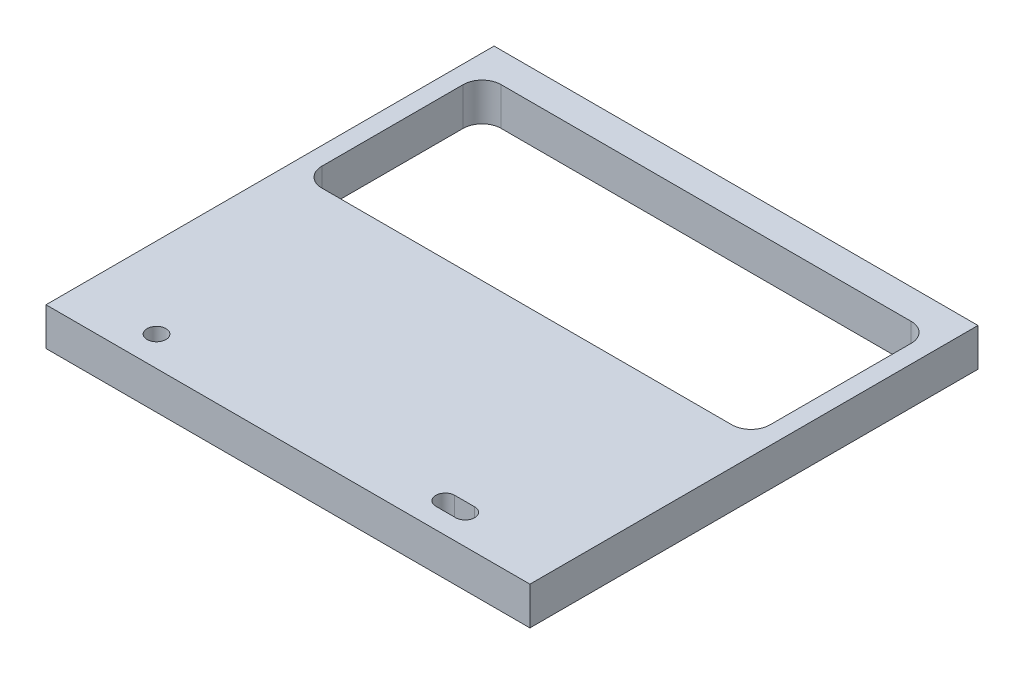
ISO-10303-21;
HEADER;
FILE_DESCRIPTION(('STEP AP214'),'2;1');
FILE_NAME('part.step','',(''),(''),'','','');
FILE_SCHEMA(('AUTOMOTIVE_DESIGN { 1 0 10303 214 1 1 1 1 }'));
ENDSEC;
DATA;
#1=APPLICATION_CONTEXT('core data for automotive mechanical design processes');
#2=APPLICATION_PROTOCOL_DEFINITION('international standard','automotive_design',2000,#1);
#3=PRODUCT_CONTEXT('',#1,'mechanical');
#4=PRODUCT('Part','Part','',(#3));
#5=PRODUCT_RELATED_PRODUCT_CATEGORY('part','',(#4));
#6=PRODUCT_DEFINITION_FORMATION('','',#4);
#7=PRODUCT_DEFINITION_CONTEXT('part definition',#1,'design');
#8=PRODUCT_DEFINITION('design','',#6,#7);
#9=PRODUCT_DEFINITION_SHAPE('','',#8);
#10=(LENGTH_UNIT() NAMED_UNIT(*) SI_UNIT(.MILLI.,.METRE.));
#11=(NAMED_UNIT(*) PLANE_ANGLE_UNIT() SI_UNIT($,.RADIAN.));
#12=(NAMED_UNIT(*) SI_UNIT($,.STERADIAN.) SOLID_ANGLE_UNIT());
#13=UNCERTAINTY_MEASURE_WITH_UNIT(LENGTH_MEASURE(1.E-05),#10,'distance_accuracy_value','');
#14=(GEOMETRIC_REPRESENTATION_CONTEXT(3) GLOBAL_UNCERTAINTY_ASSIGNED_CONTEXT((#13)) GLOBAL_UNIT_ASSIGNED_CONTEXT((#10,
#11,#12)) REPRESENTATION_CONTEXT('',''));
#15=CARTESIAN_POINT('',(0.,0.,0.));
#16=DIRECTION('',(0.,0.,1.));
#17=DIRECTION('',(1.,0.,0.));
#18=AXIS2_PLACEMENT_3D('',#15,#16,#17);
#19=CARTESIAN_POINT('',(0.,6.35,-75.));
#20=DIRECTION('',(0.,-1.,0.));
#21=DIRECTION('',(0.,0.,-1.));
#22=AXIS2_PLACEMENT_3D('',#19,#20,#21);
#23=PLANE('',#22);
#24=CARTESIAN_POINT('',(61.83,6.35,-5.));
#25=DIRECTION('',(0.,1.,0.));
#26=DIRECTION('',(0.,0.,1.));
#27=AXIS2_PLACEMENT_3D('',#24,#25,#26);
#28=CIRCLE('',#27,1.585);
#29=CARTESIAN_POINT('',(61.83,6.35,-6.585));
#30=VERTEX_POINT('',#29);
#31=CARTESIAN_POINT('',(61.83,6.35,-3.415));
#32=VERTEX_POINT('',#31);
#33=EDGE_CURVE('E211',#30,#32,#28,.T.);
#34=ORIENTED_EDGE('',*,*,#33,.F.);
#35=DIRECTION('',(-1.,0.,0.));
#36=VECTOR('',#35,1.);
#37=CARTESIAN_POINT('',(61.83,6.35,-6.585));
#38=LINE('',#37,#36);
#39=CARTESIAN_POINT('',(65.17,6.35,-6.585));
#40=VERTEX_POINT('',#39);
#41=EDGE_CURVE('E219',#40,#30,#38,.T.);
#42=ORIENTED_EDGE('',*,*,#41,.F.);
#43=CARTESIAN_POINT('',(65.17,6.35,-5.));
#44=DIRECTION('',(0.,1.,0.));
#45=DIRECTION('',(0.,0.,1.));
#46=AXIS2_PLACEMENT_3D('',#43,#44,#45);
#47=CIRCLE('',#46,1.585);
#48=CARTESIAN_POINT('',(65.17,6.35,-3.415));
#49=VERTEX_POINT('',#48);
#50=EDGE_CURVE('E216',#49,#40,#47,.T.);
#51=ORIENTED_EDGE('',*,*,#50,.F.);
#52=DIRECTION('',(1.,0.,0.));
#53=VECTOR('',#52,1.);
#54=CARTESIAN_POINT('',(61.83,6.35,-3.415));
#55=LINE('',#54,#53);
#56=EDGE_CURVE('E213',#32,#49,#55,.T.);
#57=ORIENTED_EDGE('',*,*,#56,.F.);
#58=EDGE_LOOP('',(#34,#42,#51,#57));
#59=FACE_BOUND('',#58,.T.);
#60=DIRECTION('',(0.,0.,1.));
#61=VECTOR('',#60,1.);
#62=CARTESIAN_POINT('',(0.,6.35,0.));
#63=LINE('',#62,#61);
#64=CARTESIAN_POINT('',(0.,6.35,-75.));
#65=VERTEX_POINT('',#64);
#66=CARTESIAN_POINT('',(0.,6.35,0.));
#67=VERTEX_POINT('',#66);
#68=EDGE_CURVE('E248',#65,#67,#63,.T.);
#69=ORIENTED_EDGE('',*,*,#68,.T.);
#70=DIRECTION('',(1.,0.,0.));
#71=VECTOR('',#70,1.);
#72=CARTESIAN_POINT('',(0.,6.35,0.));
#73=LINE('',#72,#71);
#74=CARTESIAN_POINT('',(81.,6.35,0.));
#75=VERTEX_POINT('',#74);
#76=EDGE_CURVE('E251',#67,#75,#73,.T.);
#77=ORIENTED_EDGE('',*,*,#76,.T.);
#78=DIRECTION('',(0.,0.,-1.));
#79=VECTOR('',#78,1.);
#80=CARTESIAN_POINT('',(81.,6.35,0.));
#81=LINE('',#80,#79);
#82=CARTESIAN_POINT('',(81.,6.35,-75.));
#83=VERTEX_POINT('',#82);
#84=EDGE_CURVE('E254',#75,#83,#81,.T.);
#85=ORIENTED_EDGE('',*,*,#84,.T.);
#86=DIRECTION('',(-1.,0.,0.));
#87=VECTOR('',#86,1.);
#88=CARTESIAN_POINT('',(0.,6.35,-75.));
#89=LINE('',#88,#87);
#90=EDGE_CURVE('E256',#83,#65,#89,.T.);
#91=ORIENTED_EDGE('',*,*,#90,.T.);
#92=EDGE_LOOP('',(#69,#77,#85,#91));
#93=FACE_BOUND('',#92,.T.);
#94=CARTESIAN_POINT('',(13.5,6.35,-5.));
#95=DIRECTION('',(0.,1.,0.));
#96=DIRECTION('',(0.,0.,1.));
#97=AXIS2_PLACEMENT_3D('',#94,#95,#96);
#98=CIRCLE('',#97,1.585);
#99=CARTESIAN_POINT('',(13.5,6.35,-3.415));
#100=VERTEX_POINT('',#99);
#101=EDGE_CURVE('E242',#100,#100,#98,.T.);
#102=ORIENTED_EDGE('',*,*,#101,.F.);
#103=EDGE_LOOP('',(#102));
#104=FACE_BOUND('',#103,.T.);
#105=CARTESIAN_POINT('',(74.825,6.35,-66.825));
#106=DIRECTION('',(0.,1.,0.));
#107=DIRECTION('',(0.,0.,-1.));
#108=AXIS2_PLACEMENT_3D('',#105,#106,#107);
#109=CIRCLE('',#108,3.175);
#110=CARTESIAN_POINT('',(78.,6.35,-66.825));
#111=VERTEX_POINT('',#110);
#112=CARTESIAN_POINT('',(74.825,6.35,-70.));
#113=VERTEX_POINT('',#112);
#114=EDGE_CURVE('E146',#111,#113,#109,.T.);
#115=ORIENTED_EDGE('',*,*,#114,.F.);
#116=DIRECTION('',(0.,0.,-1.));
#117=VECTOR('',#116,1.);
#118=CARTESIAN_POINT('',(78.,6.35,-43.175));
#119=LINE('',#118,#117);
#120=CARTESIAN_POINT('',(78.,6.35,-43.175));
#121=VERTEX_POINT('',#120);
#122=EDGE_CURVE('E179',#121,#111,#119,.T.);
#123=ORIENTED_EDGE('',*,*,#122,.F.);
#124=CARTESIAN_POINT('',(74.825,6.35,-43.175));
#125=DIRECTION('',(0.,1.,0.));
#126=DIRECTION('',(0.,0.,-1.));
#127=AXIS2_PLACEMENT_3D('',#124,#125,#126);
#128=CIRCLE('',#127,3.175);
#129=CARTESIAN_POINT('',(74.825,6.35,-40.));
#130=VERTEX_POINT('',#129);
#131=EDGE_CURVE('E177',#130,#121,#128,.T.);
#132=ORIENTED_EDGE('',*,*,#131,.F.);
#133=DIRECTION('',(1.,0.,0.));
#134=VECTOR('',#133,1.);
#135=CARTESIAN_POINT('',(6.17500000000002,6.35,-40.));
#136=LINE('',#135,#134);
#137=CARTESIAN_POINT('',(6.17500000000002,6.35,-40.));
#138=VERTEX_POINT('',#137);
#139=EDGE_CURVE('E175',#138,#130,#136,.T.);
#140=ORIENTED_EDGE('',*,*,#139,.F.);
#141=CARTESIAN_POINT('',(6.175,6.35,-43.175));
#142=DIRECTION('',(0.,1.,0.));
#143=DIRECTION('',(0.,0.,-1.));
#144=AXIS2_PLACEMENT_3D('',#141,#142,#143);
#145=CIRCLE('',#144,3.175);
#146=CARTESIAN_POINT('',(3.,6.35,-43.175));
#147=VERTEX_POINT('',#146);
#148=EDGE_CURVE('E173',#147,#138,#145,.T.);
#149=ORIENTED_EDGE('',*,*,#148,.F.);
#150=DIRECTION('',(0.,0.,1.));
#151=VECTOR('',#150,1.);
#152=CARTESIAN_POINT('',(3.,6.35,-43.175));
#153=LINE('',#152,#151);
#154=CARTESIAN_POINT('',(3.,6.35,-66.825));
#155=VERTEX_POINT('',#154);
#156=EDGE_CURVE('E169',#155,#147,#153,.T.);
#157=ORIENTED_EDGE('',*,*,#156,.F.);
#158=CARTESIAN_POINT('',(6.175,6.35,-66.825));
#159=DIRECTION('',(0.,1.,0.));
#160=DIRECTION('',(0.,0.,-1.));
#161=AXIS2_PLACEMENT_3D('',#158,#159,#160);
#162=CIRCLE('',#161,3.175);
#163=CARTESIAN_POINT('',(6.17500000000002,6.35,-70.));
#164=VERTEX_POINT('',#163);
#165=EDGE_CURVE('E167',#164,#155,#162,.T.);
#166=ORIENTED_EDGE('',*,*,#165,.F.);
#167=DIRECTION('',(-1.,0.,0.));
#168=VECTOR('',#167,1.);
#169=CARTESIAN_POINT('',(6.17500000000002,6.35,-70.));
#170=LINE('',#169,#168);
#171=EDGE_CURVE('E154',#113,#164,#170,.T.);
#172=ORIENTED_EDGE('',*,*,#171,.F.);
#173=EDGE_LOOP('',(#115,#123,#132,#140,#149,#157,#166,#172));
#174=FACE_BOUND('',#173,.T.);
#175=ADVANCED_FACE('F33',(#59,#93,#104,#174),#23,.F.);
#176=CARTESIAN_POINT('',(0.,0.,-75.));
#177=DIRECTION('',(0.,-1.,0.));
#178=DIRECTION('',(0.,0.,-1.));
#179=AXIS2_PLACEMENT_3D('',#176,#177,#178);
#180=PLANE('',#179);
#181=DIRECTION('',(-1.,0.,0.));
#182=VECTOR('',#181,1.);
#183=CARTESIAN_POINT('',(61.83,0.,-6.585));
#184=LINE('',#183,#182);
#185=CARTESIAN_POINT('',(65.17,0.,-6.585));
#186=VERTEX_POINT('',#185);
#187=CARTESIAN_POINT('',(61.83,0.,-6.585));
#188=VERTEX_POINT('',#187);
#189=EDGE_CURVE('E214',#186,#188,#184,.T.);
#190=ORIENTED_EDGE('',*,*,#189,.T.);
#191=CARTESIAN_POINT('',(61.83,0.,-5.));
#192=DIRECTION('',(0.,1.,0.));
#193=DIRECTION('',(0.,0.,1.));
#194=AXIS2_PLACEMENT_3D('',#191,#192,#193);
#195=CIRCLE('',#194,1.585);
#196=CARTESIAN_POINT('',(61.83,0.,-3.415));
#197=VERTEX_POINT('',#196);
#198=EDGE_CURVE('E162',#188,#197,#195,.T.);
#199=ORIENTED_EDGE('',*,*,#198,.T.);
#200=DIRECTION('',(1.,0.,0.));
#201=VECTOR('',#200,1.);
#202=CARTESIAN_POINT('',(61.83,0.,-3.415));
#203=LINE('',#202,#201);
#204=CARTESIAN_POINT('',(65.17,0.,-3.415));
#205=VERTEX_POINT('',#204);
#206=EDGE_CURVE('E224',#197,#205,#203,.T.);
#207=ORIENTED_EDGE('',*,*,#206,.T.);
#208=CARTESIAN_POINT('',(65.17,0.,-5.));
#209=DIRECTION('',(0.,1.,0.));
#210=DIRECTION('',(0.,0.,1.));
#211=AXIS2_PLACEMENT_3D('',#208,#209,#210);
#212=CIRCLE('',#211,1.585);
#213=EDGE_CURVE('E227',#205,#186,#212,.T.);
#214=ORIENTED_EDGE('',*,*,#213,.T.);
#215=EDGE_LOOP('',(#190,#199,#207,#214));
#216=FACE_BOUND('',#215,.T.);
#217=DIRECTION('',(0.,0.,1.));
#218=VECTOR('',#217,1.);
#219=CARTESIAN_POINT('',(0.,0.,0.));
#220=LINE('',#219,#218);
#221=CARTESIAN_POINT('',(0.,0.,-75.));
#222=VERTEX_POINT('',#221);
#223=CARTESIAN_POINT('',(0.,0.,0.));
#224=VERTEX_POINT('',#223);
#225=EDGE_CURVE('E245',#222,#224,#220,.T.);
#226=ORIENTED_EDGE('',*,*,#225,.F.);
#227=DIRECTION('',(-1.,0.,0.));
#228=VECTOR('',#227,1.);
#229=CARTESIAN_POINT('',(0.,0.,-75.));
#230=LINE('',#229,#228);
#231=CARTESIAN_POINT('',(81.,0.,-75.));
#232=VERTEX_POINT('',#231);
#233=EDGE_CURVE('E252',#232,#222,#230,.T.);
#234=ORIENTED_EDGE('',*,*,#233,.F.);
#235=DIRECTION('',(0.,0.,-1.));
#236=VECTOR('',#235,1.);
#237=CARTESIAN_POINT('',(81.,0.,0.));
#238=LINE('',#237,#236);
#239=CARTESIAN_POINT('',(81.,0.,0.));
#240=VERTEX_POINT('',#239);
#241=EDGE_CURVE('E263',#240,#232,#238,.T.);
#242=ORIENTED_EDGE('',*,*,#241,.F.);
#243=DIRECTION('',(1.,0.,0.));
#244=VECTOR('',#243,1.);
#245=CARTESIAN_POINT('',(0.,0.,0.));
#246=LINE('',#245,#244);
#247=EDGE_CURVE('E261',#224,#240,#246,.T.);
#248=ORIENTED_EDGE('',*,*,#247,.F.);
#249=EDGE_LOOP('',(#226,#234,#242,#248));
#250=FACE_BOUND('',#249,.T.);
#251=CARTESIAN_POINT('',(13.5,0.,-5.));
#252=DIRECTION('',(0.,1.,0.));
#253=DIRECTION('',(0.,0.,1.));
#254=AXIS2_PLACEMENT_3D('',#251,#252,#253);
#255=CIRCLE('',#254,1.585);
#256=CARTESIAN_POINT('',(13.5,0.,-3.415));
#257=VERTEX_POINT('',#256);
#258=EDGE_CURVE('E241',#257,#257,#255,.T.);
#259=ORIENTED_EDGE('',*,*,#258,.T.);
#260=EDGE_LOOP('',(#259));
#261=FACE_BOUND('',#260,.T.);
#262=DIRECTION('',(0.,0.,-1.));
#263=VECTOR('',#262,1.);
#264=CARTESIAN_POINT('',(78.,0.,-43.175));
#265=LINE('',#264,#263);
#266=CARTESIAN_POINT('',(78.,0.,-43.175));
#267=VERTEX_POINT('',#266);
#268=CARTESIAN_POINT('',(78.,0.,-66.825));
#269=VERTEX_POINT('',#268);
#270=EDGE_CURVE('E155',#267,#269,#265,.T.);
#271=ORIENTED_EDGE('',*,*,#270,.T.);
#272=CARTESIAN_POINT('',(74.825,0.,-66.825));
#273=DIRECTION('',(0.,1.,0.));
#274=DIRECTION('',(0.,0.,-1.));
#275=AXIS2_PLACEMENT_3D('',#272,#273,#274);
#276=CIRCLE('',#275,3.175);
#277=CARTESIAN_POINT('',(74.825,0.,-70.));
#278=VERTEX_POINT('',#277);
#279=EDGE_CURVE('E56',#269,#278,#276,.T.);
#280=ORIENTED_EDGE('',*,*,#279,.T.);
#281=DIRECTION('',(-1.,0.,0.));
#282=VECTOR('',#281,1.);
#283=CARTESIAN_POINT('',(6.17500000000002,0.,-70.));
#284=LINE('',#283,#282);
#285=CARTESIAN_POINT('',(6.17500000000002,0.,-70.));
#286=VERTEX_POINT('',#285);
#287=EDGE_CURVE('E161',#278,#286,#284,.T.);
#288=ORIENTED_EDGE('',*,*,#287,.T.);
#289=CARTESIAN_POINT('',(6.175,0.,-66.825));
#290=DIRECTION('',(0.,1.,0.));
#291=DIRECTION('',(0.,0.,-1.));
#292=AXIS2_PLACEMENT_3D('',#289,#290,#291);
#293=CIRCLE('',#292,3.175);
#294=CARTESIAN_POINT('',(3.,0.,-66.825));
#295=VERTEX_POINT('',#294);
#296=EDGE_CURVE('E183',#286,#295,#293,.T.);
#297=ORIENTED_EDGE('',*,*,#296,.T.);
#298=DIRECTION('',(0.,0.,1.));
#299=VECTOR('',#298,1.);
#300=CARTESIAN_POINT('',(3.,0.,-43.175));
#301=LINE('',#300,#299);
#302=CARTESIAN_POINT('',(3.,0.,-43.175));
#303=VERTEX_POINT('',#302);
#304=EDGE_CURVE('E186',#295,#303,#301,.T.);
#305=ORIENTED_EDGE('',*,*,#304,.T.);
#306=CARTESIAN_POINT('',(6.175,0.,-43.175));
#307=DIRECTION('',(0.,1.,0.));
#308=DIRECTION('',(0.,0.,-1.));
#309=AXIS2_PLACEMENT_3D('',#306,#307,#308);
#310=CIRCLE('',#309,3.175);
#311=CARTESIAN_POINT('',(6.17500000000002,0.,-40.));
#312=VERTEX_POINT('',#311);
#313=EDGE_CURVE('E189',#303,#312,#310,.T.);
#314=ORIENTED_EDGE('',*,*,#313,.T.);
#315=DIRECTION('',(1.,0.,0.));
#316=VECTOR('',#315,1.);
#317=CARTESIAN_POINT('',(6.17500000000002,0.,-40.));
#318=LINE('',#317,#316);
#319=CARTESIAN_POINT('',(74.825,0.,-40.));
#320=VERTEX_POINT('',#319);
#321=EDGE_CURVE('E192',#312,#320,#318,.T.);
#322=ORIENTED_EDGE('',*,*,#321,.T.);
#323=CARTESIAN_POINT('',(74.825,0.,-43.175));
#324=DIRECTION('',(0.,1.,0.));
#325=DIRECTION('',(0.,0.,-1.));
#326=AXIS2_PLACEMENT_3D('',#323,#324,#325);
#327=CIRCLE('',#326,3.175);
#328=EDGE_CURVE('E195',#320,#267,#327,.T.);
#329=ORIENTED_EDGE('',*,*,#328,.T.);
#330=EDGE_LOOP('',(#271,#280,#288,#297,#305,#314,#322,#329));
#331=FACE_BOUND('',#330,.T.);
#332=ADVANCED_FACE('F281',(#216,#250,#261,#331),#180,.T.);
#333=CARTESIAN_POINT('',(0.,6.35,0.));
#334=DIRECTION('',(1.,0.,0.));
#335=DIRECTION('',(0.,0.,-1.));
#336=AXIS2_PLACEMENT_3D('',#333,#334,#335);
#337=PLANE('',#336);
#338=ORIENTED_EDGE('',*,*,#225,.T.);
#339=DIRECTION('',(0.,-1.,0.));
#340=VECTOR('',#339,1.);
#341=CARTESIAN_POINT('',(0.,6.35,0.));
#342=LINE('',#341,#340);
#343=EDGE_CURVE('E11',#67,#224,#342,.T.);
#344=ORIENTED_EDGE('',*,*,#343,.F.);
#345=ORIENTED_EDGE('',*,*,#68,.F.);
#346=DIRECTION('',(0.,-1.,0.));
#347=VECTOR('',#346,1.);
#348=CARTESIAN_POINT('',(0.,6.35,-75.));
#349=LINE('',#348,#347);
#350=EDGE_CURVE('E258',#65,#222,#349,.T.);
#351=ORIENTED_EDGE('',*,*,#350,.T.);
#352=EDGE_LOOP('',(#338,#344,#345,#351));
#353=FACE_BOUND('',#352,.T.);
#354=ADVANCED_FACE('F35',(#353),#337,.F.);
#355=CARTESIAN_POINT('',(0.,6.35,0.));
#356=DIRECTION('',(0.,0.,-1.));
#357=DIRECTION('',(-1.,0.,0.));
#358=AXIS2_PLACEMENT_3D('',#355,#356,#357);
#359=PLANE('',#358);
#360=ORIENTED_EDGE('',*,*,#247,.T.);
#361=DIRECTION('',(0.,-1.,0.));
#362=VECTOR('',#361,1.);
#363=CARTESIAN_POINT('',(81.,6.35,0.));
#364=LINE('',#363,#362);
#365=EDGE_CURVE('E41',#75,#240,#364,.T.);
#366=ORIENTED_EDGE('',*,*,#365,.F.);
#367=ORIENTED_EDGE('',*,*,#76,.F.);
#368=ORIENTED_EDGE('',*,*,#343,.T.);
#369=EDGE_LOOP('',(#360,#366,#367,#368));
#370=FACE_BOUND('',#369,.T.);
#371=ADVANCED_FACE('F292',(#370),#359,.F.);
#372=CARTESIAN_POINT('',(81.,6.35,0.));
#373=DIRECTION('',(-1.,0.,0.));
#374=DIRECTION('',(0.,0.,1.));
#375=AXIS2_PLACEMENT_3D('',#372,#373,#374);
#376=PLANE('',#375);
#377=ORIENTED_EDGE('',*,*,#241,.T.);
#378=DIRECTION('',(0.,-1.,0.));
#379=VECTOR('',#378,1.);
#380=CARTESIAN_POINT('',(81.,6.35,-75.));
#381=LINE('',#380,#379);
#382=EDGE_CURVE('E268',#83,#232,#381,.T.);
#383=ORIENTED_EDGE('',*,*,#382,.F.);
#384=ORIENTED_EDGE('',*,*,#84,.F.);
#385=ORIENTED_EDGE('',*,*,#365,.T.);
#386=EDGE_LOOP('',(#377,#383,#384,#385));
#387=FACE_BOUND('',#386,.T.);
#388=ADVANCED_FACE('F275',(#387),#376,.F.);
#389=CARTESIAN_POINT('',(0.,6.35,-75.));
#390=DIRECTION('',(0.,0.,1.));
#391=DIRECTION('',(1.,0.,0.));
#392=AXIS2_PLACEMENT_3D('',#389,#390,#391);
#393=PLANE('',#392);
#394=ORIENTED_EDGE('',*,*,#233,.T.);
#395=ORIENTED_EDGE('',*,*,#350,.F.);
#396=ORIENTED_EDGE('',*,*,#90,.F.);
#397=ORIENTED_EDGE('',*,*,#382,.T.);
#398=EDGE_LOOP('',(#394,#395,#396,#397));
#399=FACE_BOUND('',#398,.T.);
#400=ADVANCED_FACE('F285',(#399),#393,.F.);
#401=CARTESIAN_POINT('',(13.5,6.35,-5.));
#402=DIRECTION('',(0.,-1.,0.));
#403=DIRECTION('',(0.,0.,-1.));
#404=AXIS2_PLACEMENT_3D('',#401,#402,#403);
#405=CYLINDRICAL_SURFACE('',#404,1.585);
#406=ORIENTED_EDGE('',*,*,#101,.T.);
#407=EDGE_LOOP('',(#406));
#408=FACE_BOUND('',#407,.T.);
#409=ORIENTED_EDGE('',*,*,#258,.F.);
#410=EDGE_LOOP('',(#409));
#411=FACE_BOUND('',#410,.T.);
#412=ADVANCED_FACE('F309',(#408,#411),#405,.F.);
#413=CARTESIAN_POINT('',(61.83,6.35,-5.));
#414=DIRECTION('',(0.,-1.,0.));
#415=DIRECTION('',(0.,0.,-1.));
#416=AXIS2_PLACEMENT_3D('',#413,#414,#415);
#417=CYLINDRICAL_SURFACE('',#416,1.585);
#418=ORIENTED_EDGE('',*,*,#198,.F.);
#419=DIRECTION('',(0.,-1.,0.));
#420=VECTOR('',#419,1.);
#421=CARTESIAN_POINT('',(61.83,6.35,-6.585));
#422=LINE('',#421,#420);
#423=EDGE_CURVE('E221',#30,#188,#422,.T.);
#424=ORIENTED_EDGE('',*,*,#423,.F.);
#425=ORIENTED_EDGE('',*,*,#33,.T.);
#426=DIRECTION('',(0.,-1.,0.));
#427=VECTOR('',#426,1.);
#428=CARTESIAN_POINT('',(61.83,6.35,-3.415));
#429=LINE('',#428,#427);
#430=EDGE_CURVE('E238',#32,#197,#429,.T.);
#431=ORIENTED_EDGE('',*,*,#430,.T.);
#432=EDGE_LOOP('',(#418,#424,#425,#431));
#433=FACE_BOUND('',#432,.T.);
#434=ADVANCED_FACE('F316',(#433),#417,.F.);
#435=CARTESIAN_POINT('',(61.83,6.35,-3.415));
#436=DIRECTION('',(0.,0.,-1.));
#437=DIRECTION('',(-1.,0.,0.));
#438=AXIS2_PLACEMENT_3D('',#435,#436,#437);
#439=PLANE('',#438);
#440=ORIENTED_EDGE('',*,*,#206,.F.);
#441=ORIENTED_EDGE('',*,*,#430,.F.);
#442=ORIENTED_EDGE('',*,*,#56,.T.);
#443=DIRECTION('',(0.,-1.,0.));
#444=VECTOR('',#443,1.);
#445=CARTESIAN_POINT('',(65.17,6.35,-3.415));
#446=LINE('',#445,#444);
#447=EDGE_CURVE('E236',#49,#205,#446,.T.);
#448=ORIENTED_EDGE('',*,*,#447,.T.);
#449=EDGE_LOOP('',(#440,#441,#442,#448));
#450=FACE_BOUND('',#449,.T.);
#451=ADVANCED_FACE('F321',(#450),#439,.T.);
#452=CARTESIAN_POINT('',(65.17,6.35,-5.));
#453=DIRECTION('',(0.,-1.,0.));
#454=DIRECTION('',(0.,0.,-1.));
#455=AXIS2_PLACEMENT_3D('',#452,#453,#454);
#456=CYLINDRICAL_SURFACE('',#455,1.585);
#457=ORIENTED_EDGE('',*,*,#213,.F.);
#458=ORIENTED_EDGE('',*,*,#447,.F.);
#459=ORIENTED_EDGE('',*,*,#50,.T.);
#460=DIRECTION('',(0.,-1.,0.));
#461=VECTOR('',#460,1.);
#462=CARTESIAN_POINT('',(65.17,6.35,-6.585));
#463=LINE('',#462,#461);
#464=EDGE_CURVE('E234',#40,#186,#463,.T.);
#465=ORIENTED_EDGE('',*,*,#464,.T.);
#466=EDGE_LOOP('',(#457,#458,#459,#465));
#467=FACE_BOUND('',#466,.T.);
#468=ADVANCED_FACE('F365',(#467),#456,.F.);
#469=CARTESIAN_POINT('',(61.83,6.35,-6.585));
#470=DIRECTION('',(0.,0.,1.));
#471=DIRECTION('',(1.,0.,0.));
#472=AXIS2_PLACEMENT_3D('',#469,#470,#471);
#473=PLANE('',#472);
#474=ORIENTED_EDGE('',*,*,#189,.F.);
#475=ORIENTED_EDGE('',*,*,#464,.F.);
#476=ORIENTED_EDGE('',*,*,#41,.T.);
#477=ORIENTED_EDGE('',*,*,#423,.T.);
#478=EDGE_LOOP('',(#474,#475,#476,#477));
#479=FACE_BOUND('',#478,.T.);
#480=ADVANCED_FACE('F362',(#479),#473,.T.);
#481=CARTESIAN_POINT('',(74.825,6.35,-66.825));
#482=DIRECTION('',(0.,-1.,0.));
#483=DIRECTION('',(0.,0.,-1.));
#484=AXIS2_PLACEMENT_3D('',#481,#482,#483);
#485=CYLINDRICAL_SURFACE('',#484,3.175);
#486=ORIENTED_EDGE('',*,*,#279,.F.);
#487=DIRECTION('',(0.,-1.,0.));
#488=VECTOR('',#487,1.);
#489=CARTESIAN_POINT('',(78.,6.35,-66.825));
#490=LINE('',#489,#488);
#491=EDGE_CURVE('E150',#111,#269,#490,.T.);
#492=ORIENTED_EDGE('',*,*,#491,.F.);
#493=ORIENTED_EDGE('',*,*,#114,.T.);
#494=DIRECTION('',(0.,-1.,0.));
#495=VECTOR('',#494,1.);
#496=CARTESIAN_POINT('',(74.825,6.35,-70.));
#497=LINE('',#496,#495);
#498=EDGE_CURVE('E149',#113,#278,#497,.T.);
#499=ORIENTED_EDGE('',*,*,#498,.T.);
#500=EDGE_LOOP('',(#486,#492,#493,#499));
#501=FACE_BOUND('',#500,.T.);
#502=ADVANCED_FACE('F148',(#501),#485,.F.);
#503=CARTESIAN_POINT('',(6.17500000000002,6.35,-70.));
#504=DIRECTION('',(0.,0.,1.));
#505=DIRECTION('',(1.,0.,0.));
#506=AXIS2_PLACEMENT_3D('',#503,#504,#505);
#507=PLANE('',#506);
#508=ORIENTED_EDGE('',*,*,#287,.F.);
#509=ORIENTED_EDGE('',*,*,#498,.F.);
#510=ORIENTED_EDGE('',*,*,#171,.T.);
#511=DIRECTION('',(0.,-1.,0.));
#512=VECTOR('',#511,1.);
#513=CARTESIAN_POINT('',(6.17500000000002,6.35,-70.));
#514=LINE('',#513,#512);
#515=EDGE_CURVE('E163',#164,#286,#514,.T.);
#516=ORIENTED_EDGE('',*,*,#515,.T.);
#517=EDGE_LOOP('',(#508,#509,#510,#516));
#518=FACE_BOUND('',#517,.T.);
#519=ADVANCED_FACE('F158',(#518),#507,.T.);
#520=CARTESIAN_POINT('',(6.175,6.35,-66.825));
#521=DIRECTION('',(0.,-1.,0.));
#522=DIRECTION('',(0.,0.,-1.));
#523=AXIS2_PLACEMENT_3D('',#520,#521,#522);
#524=CYLINDRICAL_SURFACE('',#523,3.175);
#525=ORIENTED_EDGE('',*,*,#296,.F.);
#526=ORIENTED_EDGE('',*,*,#515,.F.);
#527=ORIENTED_EDGE('',*,*,#165,.T.);
#528=DIRECTION('',(0.,-1.,0.));
#529=VECTOR('',#528,1.);
#530=CARTESIAN_POINT('',(3.,6.35,-66.825));
#531=LINE('',#530,#529);
#532=EDGE_CURVE('E208',#155,#295,#531,.T.);
#533=ORIENTED_EDGE('',*,*,#532,.T.);
#534=EDGE_LOOP('',(#525,#526,#527,#533));
#535=FACE_BOUND('',#534,.T.);
#536=ADVANCED_FACE('F349',(#535),#524,.F.);
#537=CARTESIAN_POINT('',(3.,6.35,-43.175));
#538=DIRECTION('',(1.,0.,0.));
#539=DIRECTION('',(0.,0.,-1.));
#540=AXIS2_PLACEMENT_3D('',#537,#538,#539);
#541=PLANE('',#540);
#542=ORIENTED_EDGE('',*,*,#304,.F.);
#543=ORIENTED_EDGE('',*,*,#532,.F.);
#544=ORIENTED_EDGE('',*,*,#156,.T.);
#545=DIRECTION('',(0.,-1.,0.));
#546=VECTOR('',#545,1.);
#547=CARTESIAN_POINT('',(3.,6.35,-43.175));
#548=LINE('',#547,#546);
#549=EDGE_CURVE('E206',#147,#303,#548,.T.);
#550=ORIENTED_EDGE('',*,*,#549,.T.);
#551=EDGE_LOOP('',(#542,#543,#544,#550));
#552=FACE_BOUND('',#551,.T.);
#553=ADVANCED_FACE('F346',(#552),#541,.T.);
#554=CARTESIAN_POINT('',(6.175,6.35,-43.175));
#555=DIRECTION('',(0.,-1.,0.));
#556=DIRECTION('',(0.,0.,-1.));
#557=AXIS2_PLACEMENT_3D('',#554,#555,#556);
#558=CYLINDRICAL_SURFACE('',#557,3.175);
#559=ORIENTED_EDGE('',*,*,#313,.F.);
#560=ORIENTED_EDGE('',*,*,#549,.F.);
#561=ORIENTED_EDGE('',*,*,#148,.T.);
#562=DIRECTION('',(0.,-1.,0.));
#563=VECTOR('',#562,1.);
#564=CARTESIAN_POINT('',(6.17500000000002,6.35,-40.));
#565=LINE('',#564,#563);
#566=EDGE_CURVE('E204',#138,#312,#565,.T.);
#567=ORIENTED_EDGE('',*,*,#566,.T.);
#568=EDGE_LOOP('',(#559,#560,#561,#567));
#569=FACE_BOUND('',#568,.T.);
#570=ADVANCED_FACE('F341',(#569),#558,.F.);
#571=CARTESIAN_POINT('',(6.17500000000002,6.35,-40.));
#572=DIRECTION('',(0.,0.,-1.));
#573=DIRECTION('',(-1.,0.,0.));
#574=AXIS2_PLACEMENT_3D('',#571,#572,#573);
#575=PLANE('',#574);
#576=ORIENTED_EDGE('',*,*,#321,.F.);
#577=ORIENTED_EDGE('',*,*,#566,.F.);
#578=ORIENTED_EDGE('',*,*,#139,.T.);
#579=DIRECTION('',(0.,-1.,0.));
#580=VECTOR('',#579,1.);
#581=CARTESIAN_POINT('',(74.825,6.35,-40.));
#582=LINE('',#581,#580);
#583=EDGE_CURVE('E202',#130,#320,#582,.T.);
#584=ORIENTED_EDGE('',*,*,#583,.T.);
#585=EDGE_LOOP('',(#576,#577,#578,#584));
#586=FACE_BOUND('',#585,.T.);
#587=ADVANCED_FACE('F337',(#586),#575,.T.);
#588=CARTESIAN_POINT('',(74.825,6.35,-43.175));
#589=DIRECTION('',(0.,-1.,0.));
#590=DIRECTION('',(0.,0.,-1.));
#591=AXIS2_PLACEMENT_3D('',#588,#589,#590);
#592=CYLINDRICAL_SURFACE('',#591,3.175);
#593=ORIENTED_EDGE('',*,*,#328,.F.);
#594=ORIENTED_EDGE('',*,*,#583,.F.);
#595=ORIENTED_EDGE('',*,*,#131,.T.);
#596=DIRECTION('',(0.,-1.,0.));
#597=VECTOR('',#596,1.);
#598=CARTESIAN_POINT('',(78.,6.35,-43.175));
#599=LINE('',#598,#597);
#600=EDGE_CURVE('E48',#121,#267,#599,.T.);
#601=ORIENTED_EDGE('',*,*,#600,.T.);
#602=EDGE_LOOP('',(#593,#594,#595,#601));
#603=FACE_BOUND('',#602,.T.);
#604=ADVANCED_FACE('F334',(#603),#592,.F.);
#605=CARTESIAN_POINT('',(78.,6.35,-43.175));
#606=DIRECTION('',(-1.,0.,0.));
#607=DIRECTION('',(0.,0.,1.));
#608=AXIS2_PLACEMENT_3D('',#605,#606,#607);
#609=PLANE('',#608);
#610=ORIENTED_EDGE('',*,*,#270,.F.);
#611=ORIENTED_EDGE('',*,*,#600,.F.);
#612=ORIENTED_EDGE('',*,*,#122,.T.);
#613=ORIENTED_EDGE('',*,*,#491,.T.);
#614=EDGE_LOOP('',(#610,#611,#612,#613));
#615=FACE_BOUND('',#614,.T.);
#616=ADVANCED_FACE('F328',(#615),#609,.T.);
#617=CLOSED_SHELL('',(#175,#332,#354,#371,#388,#400,#412,#434,#451,#468,#480,#502,#519,#536,
#553,#570,#587,#604,#616));
#618=MANIFOLD_SOLID_BREP('B2',#617);
#619=ADVANCED_BREP_SHAPE_REPRESENTATION('',(#18,#618),#14);
#620=SHAPE_DEFINITION_REPRESENTATION(#9,#619);
ENDSEC;
END-ISO-10303-21;
